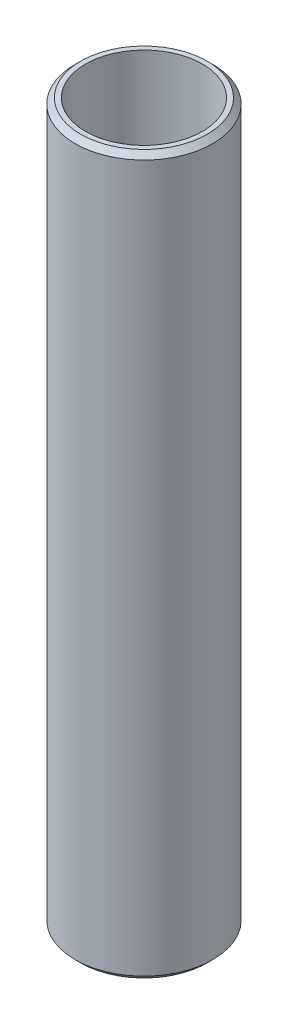
ISO-10303-21;
HEADER;
FILE_DESCRIPTION(('STEP AP214'),'2;1');
FILE_NAME('part.step','',(''),(''),'','','');
FILE_SCHEMA(('AUTOMOTIVE_DESIGN { 1 0 10303 214 1 1 1 1 }'));
ENDSEC;
DATA;
#1=APPLICATION_CONTEXT('core data for automotive mechanical design processes');
#2=APPLICATION_PROTOCOL_DEFINITION('international standard','automotive_design',2000,#1);
#3=PRODUCT_CONTEXT('',#1,'mechanical');
#4=PRODUCT('Part','Part','',(#3));
#5=PRODUCT_RELATED_PRODUCT_CATEGORY('part','',(#4));
#6=PRODUCT_DEFINITION_FORMATION('','',#4);
#7=PRODUCT_DEFINITION_CONTEXT('part definition',#1,'design');
#8=PRODUCT_DEFINITION('design','',#6,#7);
#9=PRODUCT_DEFINITION_SHAPE('','',#8);
#10=(LENGTH_UNIT() NAMED_UNIT(*) SI_UNIT(.MILLI.,.METRE.));
#11=(NAMED_UNIT(*) PLANE_ANGLE_UNIT() SI_UNIT($,.RADIAN.));
#12=(NAMED_UNIT(*) SI_UNIT($,.STERADIAN.) SOLID_ANGLE_UNIT());
#13=UNCERTAINTY_MEASURE_WITH_UNIT(LENGTH_MEASURE(1.E-05),#10,'distance_accuracy_value','');
#14=(GEOMETRIC_REPRESENTATION_CONTEXT(3) GLOBAL_UNCERTAINTY_ASSIGNED_CONTEXT((#13)) GLOBAL_UNIT_ASSIGNED_CONTEXT((#10,
#11,#12)) REPRESENTATION_CONTEXT('',''));
#15=CARTESIAN_POINT('',(0.,0.,0.));
#16=DIRECTION('',(0.,0.,1.));
#17=DIRECTION('',(1.,0.,0.));
#18=AXIS2_PLACEMENT_3D('',#15,#16,#17);
#19=CARTESIAN_POINT('',(0.,600.,0.));
#20=DIRECTION('',(0.,-1.,0.));
#21=DIRECTION('',(0.,0.,-1.));
#22=AXIS2_PLACEMENT_3D('',#19,#20,#21);
#23=CYLINDRICAL_SURFACE('',#22,57.5);
#24=CARTESIAN_POINT('',(0.,595.460197325817,0.));
#25=DIRECTION('',(0.,1.,0.));
#26=DIRECTION('',(0.,0.,1.));
#27=AXIS2_PLACEMENT_3D('',#24,#25,#26);
#28=CIRCLE('',#27,57.5);
#29=CARTESIAN_POINT('',(0.,595.460197325817,57.5));
#30=VERTEX_POINT('',#29);
#31=EDGE_CURVE('E50',#30,#30,#28,.F.);
#32=ORIENTED_EDGE('',*,*,#31,.T.);
#33=EDGE_LOOP('',(#32));
#34=FACE_BOUND('',#33,.T.);
#35=CARTESIAN_POINT('',(0.,4.53980267418275,0.));
#36=DIRECTION('',(0.,1.,0.));
#37=DIRECTION('',(0.,0.,1.));
#38=AXIS2_PLACEMENT_3D('',#35,#36,#37);
#39=CIRCLE('',#38,57.5);
#40=CARTESIAN_POINT('',(0.,4.53980267418275,57.5));
#41=VERTEX_POINT('',#40);
#42=EDGE_CURVE('E51',#41,#41,#39,.T.);
#43=ORIENTED_EDGE('',*,*,#42,.T.);
#44=EDGE_LOOP('',(#43));
#45=FACE_BOUND('',#44,.T.);
#46=ADVANCED_FACE('F39',(#34,#45),#23,.T.);
#47=CARTESIAN_POINT('',(0.,600.,0.));
#48=DIRECTION('',(0.,1.,0.));
#49=DIRECTION('',(0.,0.,1.));
#50=AXIS2_PLACEMENT_3D('',#47,#48,#49);
#51=PLANE('',#50);
#52=CARTESIAN_POINT('',(0.,600.,0.));
#53=DIRECTION('',(0.,1.,0.));
#54=DIRECTION('',(0.,0.,1.));
#55=AXIS2_PLACEMENT_3D('',#52,#53,#54);
#56=CIRCLE('',#55,52.9601973258172);
#57=CARTESIAN_POINT('',(0.,600.,52.9601973258172));
#58=VERTEX_POINT('',#57);
#59=EDGE_CURVE('E54',#58,#58,#56,.T.);
#60=ORIENTED_EDGE('',*,*,#59,.T.);
#61=EDGE_LOOP('',(#60));
#62=FACE_BOUND('',#61,.T.);
#63=CARTESIAN_POINT('',(0.,600.,0.));
#64=DIRECTION('',(0.,1.,0.));
#65=DIRECTION('',(0.,0.,1.));
#66=AXIS2_PLACEMENT_3D('',#63,#64,#65);
#67=CIRCLE('',#66,48.8580878154552);
#68=CARTESIAN_POINT('',(0.,600.,48.8580878154552));
#69=VERTEX_POINT('',#68);
#70=EDGE_CURVE('E58',#69,#69,#67,.T.);
#71=ORIENTED_EDGE('',*,*,#70,.F.);
#72=EDGE_LOOP('',(#71));
#73=FACE_BOUND('',#72,.T.);
#74=ADVANCED_FACE('F69',(#62,#73),#51,.T.);
#75=CARTESIAN_POINT('',(0.,0.,0.));
#76=DIRECTION('',(0.,1.,0.));
#77=DIRECTION('',(0.,0.,1.));
#78=AXIS2_PLACEMENT_3D('',#75,#76,#77);
#79=PLANE('',#78);
#80=CARTESIAN_POINT('',(0.,0.,0.));
#81=DIRECTION('',(0.,1.,0.));
#82=DIRECTION('',(0.,0.,1.));
#83=AXIS2_PLACEMENT_3D('',#80,#81,#82);
#84=CIRCLE('',#83,52.9601973258173);
#85=CARTESIAN_POINT('',(0.,0.,52.9601973258173));
#86=VERTEX_POINT('',#85);
#87=EDGE_CURVE('E10',#86,#86,#84,.F.);
#88=ORIENTED_EDGE('',*,*,#87,.T.);
#89=EDGE_LOOP('',(#88));
#90=FACE_BOUND('',#89,.T.);
#91=CARTESIAN_POINT('',(0.,0.,0.));
#92=DIRECTION('',(0.,1.,0.));
#93=DIRECTION('',(0.,0.,1.));
#94=AXIS2_PLACEMENT_3D('',#91,#92,#93);
#95=CIRCLE('',#94,48.8580878154552);
#96=CARTESIAN_POINT('',(0.,0.,48.8580878154552));
#97=VERTEX_POINT('',#96);
#98=EDGE_CURVE('E63',#97,#97,#95,.T.);
#99=ORIENTED_EDGE('',*,*,#98,.T.);
#100=EDGE_LOOP('',(#99));
#101=FACE_BOUND('',#100,.T.);
#102=ADVANCED_FACE('F75',(#90,#101),#79,.F.);
#103=CARTESIAN_POINT('',(0.,600.,0.));
#104=DIRECTION('',(0.,-1.,0.));
#105=DIRECTION('',(0.,0.,-1.));
#106=AXIS2_PLACEMENT_3D('',#103,#104,#105);
#107=CYLINDRICAL_SURFACE('',#106,48.8580878154552);
#108=ORIENTED_EDGE('',*,*,#70,.T.);
#109=EDGE_LOOP('',(#108));
#110=FACE_BOUND('',#109,.T.);
#111=ORIENTED_EDGE('',*,*,#98,.F.);
#112=EDGE_LOOP('',(#111));
#113=FACE_BOUND('',#112,.T.);
#114=ADVANCED_FACE('F70',(#110,#113),#107,.F.);
#115=CARTESIAN_POINT('',(0.,600.,0.));
#116=DIRECTION('',(0.,-1.,0.));
#117=DIRECTION('',(0.,0.,-1.));
#118=AXIS2_PLACEMENT_3D('',#115,#116,#117);
#119=CONICAL_SURFACE('',#118,52.9601973258172,0.785398163397443);
#120=ORIENTED_EDGE('',*,*,#31,.F.);
#121=EDGE_LOOP('',(#120));
#122=FACE_BOUND('',#121,.T.);
#123=ORIENTED_EDGE('',*,*,#59,.F.);
#124=EDGE_LOOP('',(#123));
#125=FACE_BOUND('',#124,.T.);
#126=ADVANCED_FACE('F81',(#122,#125),#119,.T.);
#127=CARTESIAN_POINT('',(0.,4.53980267418275,0.));
#128=DIRECTION('',(0.,1.,0.));
#129=DIRECTION('',(0.,0.,1.));
#130=AXIS2_PLACEMENT_3D('',#127,#128,#129);
#131=CONICAL_SURFACE('',#130,57.5,0.785398163397448);
#132=ORIENTED_EDGE('',*,*,#87,.F.);
#133=EDGE_LOOP('',(#132));
#134=FACE_BOUND('',#133,.T.);
#135=ORIENTED_EDGE('',*,*,#42,.F.);
#136=EDGE_LOOP('',(#135));
#137=FACE_BOUND('',#136,.T.);
#138=ADVANCED_FACE('F45',(#134,#137),#131,.T.);
#139=CLOSED_SHELL('',(#46,#74,#102,#114,#126,#138));
#140=MANIFOLD_SOLID_BREP('B2',#139);
#141=ADVANCED_BREP_SHAPE_REPRESENTATION('',(#18,#140),#14);
#142=SHAPE_DEFINITION_REPRESENTATION(#9,#141);
ENDSEC;
END-ISO-10303-21;
